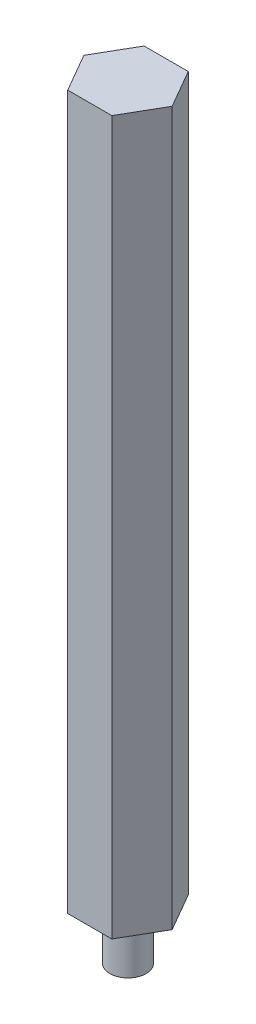
ISO-10303-21;
HEADER;
FILE_DESCRIPTION(('STEP AP214'),'2;1');
FILE_NAME('part.step','',(''),(''),'','','');
FILE_SCHEMA(('AUTOMOTIVE_DESIGN { 1 0 10303 214 1 1 1 1 }'));
ENDSEC;
DATA;
#1=APPLICATION_CONTEXT('core data for automotive mechanical design processes');
#2=APPLICATION_PROTOCOL_DEFINITION('international standard','automotive_design',2000,#1);
#3=PRODUCT_CONTEXT('',#1,'mechanical');
#4=PRODUCT('Part','Part','',(#3));
#5=PRODUCT_RELATED_PRODUCT_CATEGORY('part','',(#4));
#6=PRODUCT_DEFINITION_FORMATION('','',#4);
#7=PRODUCT_DEFINITION_CONTEXT('part definition',#1,'design');
#8=PRODUCT_DEFINITION('design','',#6,#7);
#9=PRODUCT_DEFINITION_SHAPE('','',#8);
#10=(LENGTH_UNIT() NAMED_UNIT(*) SI_UNIT(.MILLI.,.METRE.));
#11=(NAMED_UNIT(*) PLANE_ANGLE_UNIT() SI_UNIT($,.RADIAN.));
#12=(NAMED_UNIT(*) SI_UNIT($,.STERADIAN.) SOLID_ANGLE_UNIT());
#13=UNCERTAINTY_MEASURE_WITH_UNIT(LENGTH_MEASURE(1.E-05),#10,'distance_accuracy_value','');
#14=(GEOMETRIC_REPRESENTATION_CONTEXT(3) GLOBAL_UNCERTAINTY_ASSIGNED_CONTEXT((#13)) GLOBAL_UNIT_ASSIGNED_CONTEXT((#10,
#11,#12)) REPRESENTATION_CONTEXT('',''));
#15=CARTESIAN_POINT('',(0.,0.,0.));
#16=DIRECTION('',(0.,0.,1.));
#17=DIRECTION('',(1.,0.,0.));
#18=AXIS2_PLACEMENT_3D('',#15,#16,#17);
#19=CARTESIAN_POINT('',(3.66617420935413,127.,6.35));
#20=DIRECTION('',(-0.866025403784439,0.,-0.5));
#21=DIRECTION('',(-0.5,0.,0.866025403784439));
#22=AXIS2_PLACEMENT_3D('',#19,#20,#21);
#23=PLANE('',#22);
#24=DIRECTION('',(-0.5,0.,0.866025403784439));
#25=VECTOR('',#24,1.);
#26=CARTESIAN_POINT('',(3.66617420935413,8.50000000000001,6.35));
#27=LINE('',#26,#25);
#28=CARTESIAN_POINT('',(7.33234841870825,8.50000000000001,0.));
#29=VERTEX_POINT('',#28);
#30=CARTESIAN_POINT('',(3.66617420935413,8.50000000000001,6.35));
#31=VERTEX_POINT('',#30);
#32=EDGE_CURVE('E46',#29,#31,#27,.T.);
#33=ORIENTED_EDGE('',*,*,#32,.F.);
#34=DIRECTION('',(0.,-1.,0.));
#35=VECTOR('',#34,1.);
#36=CARTESIAN_POINT('',(7.33234841870825,127.,0.));
#37=LINE('',#36,#35);
#38=CARTESIAN_POINT('',(7.33234841870825,127.,0.));
#39=VERTEX_POINT('',#38);
#40=EDGE_CURVE('E40',#39,#29,#37,.T.);
#41=ORIENTED_EDGE('',*,*,#40,.F.);
#42=DIRECTION('',(0.5,0.,-0.866025403784439));
#43=VECTOR('',#42,1.);
#44=CARTESIAN_POINT('',(3.66617420935413,127.,6.35));
#45=LINE('',#44,#43);
#46=CARTESIAN_POINT('',(3.66617420935413,127.,6.35));
#47=VERTEX_POINT('',#46);
#48=EDGE_CURVE('E122',#47,#39,#45,.T.);
#49=ORIENTED_EDGE('',*,*,#48,.F.);
#50=DIRECTION('',(0.,-1.,0.));
#51=VECTOR('',#50,1.);
#52=CARTESIAN_POINT('',(3.66617420935413,127.,6.35));
#53=LINE('',#52,#51);
#54=EDGE_CURVE('E101',#47,#31,#53,.T.);
#55=ORIENTED_EDGE('',*,*,#54,.T.);
#56=EDGE_LOOP('',(#33,#41,#49,#55));
#57=FACE_BOUND('',#56,.T.);
#58=ADVANCED_FACE('F33',(#57),#23,.F.);
#59=CARTESIAN_POINT('',(7.33234841870825,127.,0.));
#60=DIRECTION('',(-0.866025403784439,0.,0.5));
#61=DIRECTION('',(0.5,0.,0.866025403784439));
#62=AXIS2_PLACEMENT_3D('',#59,#60,#61);
#63=PLANE('',#62);
#64=DIRECTION('',(0.5,0.,0.866025403784439));
#65=VECTOR('',#64,1.);
#66=CARTESIAN_POINT('',(7.33234841870825,8.50000000000001,0.));
#67=LINE('',#66,#65);
#68=CARTESIAN_POINT('',(3.66617420935412,8.50000000000001,-6.35000000000001));
#69=VERTEX_POINT('',#68);
#70=EDGE_CURVE('E118',#69,#29,#67,.T.);
#71=ORIENTED_EDGE('',*,*,#70,.F.);
#72=DIRECTION('',(0.,-1.,0.));
#73=VECTOR('',#72,1.);
#74=CARTESIAN_POINT('',(3.66617420935412,127.,-6.35000000000001));
#75=LINE('',#74,#73);
#76=CARTESIAN_POINT('',(3.66617420935412,127.,-6.35000000000001));
#77=VERTEX_POINT('',#76);
#78=EDGE_CURVE('E110',#77,#69,#75,.T.);
#79=ORIENTED_EDGE('',*,*,#78,.F.);
#80=DIRECTION('',(-0.5,0.,-0.866025403784439));
#81=VECTOR('',#80,1.);
#82=CARTESIAN_POINT('',(7.33234841870825,127.,0.));
#83=LINE('',#82,#81);
#84=EDGE_CURVE('E119',#39,#77,#83,.T.);
#85=ORIENTED_EDGE('',*,*,#84,.F.);
#86=ORIENTED_EDGE('',*,*,#40,.T.);
#87=EDGE_LOOP('',(#71,#79,#85,#86));
#88=FACE_BOUND('',#87,.T.);
#89=ADVANCED_FACE('F116',(#88),#63,.F.);
#90=CARTESIAN_POINT('',(3.66617420935412,127.,-6.35000000000001));
#91=DIRECTION('',(0.,0.,1.));
#92=DIRECTION('',(1.,0.,0.));
#93=AXIS2_PLACEMENT_3D('',#90,#91,#92);
#94=PLANE('',#93);
#95=DIRECTION('',(1.,0.,0.));
#96=VECTOR('',#95,1.);
#97=CARTESIAN_POINT('',(3.66617420935412,8.50000000000001,-6.35000000000001));
#98=LINE('',#97,#96);
#99=CARTESIAN_POINT('',(-3.66617420935413,8.50000000000001,-6.35000000000001));
#100=VERTEX_POINT('',#99);
#101=EDGE_CURVE('E125',#100,#69,#98,.T.);
#102=ORIENTED_EDGE('',*,*,#101,.F.);
#103=DIRECTION('',(0.,-1.,0.));
#104=VECTOR('',#103,1.);
#105=CARTESIAN_POINT('',(-3.66617420935413,127.,-6.35000000000001));
#106=LINE('',#105,#104);
#107=CARTESIAN_POINT('',(-3.66617420935413,127.,-6.35000000000001));
#108=VERTEX_POINT('',#107);
#109=EDGE_CURVE('E103',#108,#100,#106,.T.);
#110=ORIENTED_EDGE('',*,*,#109,.F.);
#111=DIRECTION('',(-1.,0.,0.));
#112=VECTOR('',#111,1.);
#113=CARTESIAN_POINT('',(3.66617420935412,127.,-6.35000000000001));
#114=LINE('',#113,#112);
#115=EDGE_CURVE('E130',#77,#108,#114,.T.);
#116=ORIENTED_EDGE('',*,*,#115,.F.);
#117=ORIENTED_EDGE('',*,*,#78,.T.);
#118=EDGE_LOOP('',(#102,#110,#116,#117));
#119=FACE_BOUND('',#118,.T.);
#120=ADVANCED_FACE('F168',(#119),#94,.F.);
#121=CARTESIAN_POINT('',(-3.66617420935413,127.,-6.35000000000001));
#122=DIRECTION('',(0.866025403784439,0.,0.499999999999999));
#123=DIRECTION('',(0.5,0.,-0.866025403784439));
#124=AXIS2_PLACEMENT_3D('',#121,#122,#123);
#125=PLANE('',#124);
#126=DIRECTION('',(0.5,0.,-0.866025403784439));
#127=VECTOR('',#126,1.);
#128=CARTESIAN_POINT('',(-3.66617420935413,8.50000000000001,-6.35000000000001));
#129=LINE('',#128,#127);
#130=CARTESIAN_POINT('',(-7.33234841870825,8.50000000000001,0.));
#131=VERTEX_POINT('',#130);
#132=EDGE_CURVE('E97',#131,#100,#129,.T.);
#133=ORIENTED_EDGE('',*,*,#132,.F.);
#134=DIRECTION('',(0.,-1.,0.));
#135=VECTOR('',#134,1.);
#136=CARTESIAN_POINT('',(-7.33234841870825,127.,0.));
#137=LINE('',#136,#135);
#138=CARTESIAN_POINT('',(-7.33234841870825,127.,0.));
#139=VERTEX_POINT('',#138);
#140=EDGE_CURVE('E96',#139,#131,#137,.T.);
#141=ORIENTED_EDGE('',*,*,#140,.F.);
#142=DIRECTION('',(-0.5,0.,0.866025403784439));
#143=VECTOR('',#142,1.);
#144=CARTESIAN_POINT('',(-3.66617420935413,127.,-6.35000000000001));
#145=LINE('',#144,#143);
#146=EDGE_CURVE('E132',#108,#139,#145,.T.);
#147=ORIENTED_EDGE('',*,*,#146,.F.);
#148=ORIENTED_EDGE('',*,*,#109,.T.);
#149=EDGE_LOOP('',(#133,#141,#147,#148));
#150=FACE_BOUND('',#149,.T.);
#151=ADVANCED_FACE('F140',(#150),#125,.F.);
#152=CARTESIAN_POINT('',(-7.33234841870825,127.,0.));
#153=DIRECTION('',(0.866025403784438,0.,-0.5));
#154=DIRECTION('',(-0.5,0.,-0.866025403784438));
#155=AXIS2_PLACEMENT_3D('',#152,#153,#154);
#156=PLANE('',#155);
#157=DIRECTION('',(-0.5,0.,-0.866025403784438));
#158=VECTOR('',#157,1.);
#159=CARTESIAN_POINT('',(-7.33234841870825,8.50000000000001,0.));
#160=LINE('',#159,#158);
#161=CARTESIAN_POINT('',(-3.66617420935412,8.50000000000001,6.35));
#162=VERTEX_POINT('',#161);
#163=EDGE_CURVE('E84',#162,#131,#160,.T.);
#164=ORIENTED_EDGE('',*,*,#163,.F.);
#165=DIRECTION('',(0.,-1.,0.));
#166=VECTOR('',#165,1.);
#167=CARTESIAN_POINT('',(-3.66617420935412,127.,6.35));
#168=LINE('',#167,#166);
#169=CARTESIAN_POINT('',(-3.66617420935412,127.,6.35));
#170=VERTEX_POINT('',#169);
#171=EDGE_CURVE('E94',#170,#162,#168,.T.);
#172=ORIENTED_EDGE('',*,*,#171,.F.);
#173=DIRECTION('',(0.5,0.,0.866025403784438));
#174=VECTOR('',#173,1.);
#175=CARTESIAN_POINT('',(-7.33234841870825,127.,0.));
#176=LINE('',#175,#174);
#177=EDGE_CURVE('E134',#139,#170,#176,.T.);
#178=ORIENTED_EDGE('',*,*,#177,.F.);
#179=ORIENTED_EDGE('',*,*,#140,.T.);
#180=EDGE_LOOP('',(#164,#172,#178,#179));
#181=FACE_BOUND('',#180,.T.);
#182=ADVANCED_FACE('F92',(#181),#156,.F.);
#183=CARTESIAN_POINT('',(-3.66617420935412,127.,6.35));
#184=DIRECTION('',(0.,0.,-1.));
#185=DIRECTION('',(-1.,0.,0.));
#186=AXIS2_PLACEMENT_3D('',#183,#184,#185);
#187=PLANE('',#186);
#188=DIRECTION('',(-1.,0.,0.));
#189=VECTOR('',#188,1.);
#190=CARTESIAN_POINT('',(-3.66617420935412,8.50000000000001,6.35));
#191=LINE('',#190,#189);
#192=EDGE_CURVE('E11',#31,#162,#191,.T.);
#193=ORIENTED_EDGE('',*,*,#192,.F.);
#194=ORIENTED_EDGE('',*,*,#54,.F.);
#195=DIRECTION('',(1.,0.,0.));
#196=VECTOR('',#195,1.);
#197=CARTESIAN_POINT('',(-3.66617420935412,127.,6.35));
#198=LINE('',#197,#196);
#199=EDGE_CURVE('E54',#170,#47,#198,.T.);
#200=ORIENTED_EDGE('',*,*,#199,.F.);
#201=ORIENTED_EDGE('',*,*,#171,.T.);
#202=EDGE_LOOP('',(#193,#194,#200,#201));
#203=FACE_BOUND('',#202,.T.);
#204=ADVANCED_FACE('F100',(#203),#187,.F.);
#205=CARTESIAN_POINT('',(0.,127.,0.));
#206=DIRECTION('',(0.,1.,0.));
#207=DIRECTION('',(0.,0.,1.));
#208=AXIS2_PLACEMENT_3D('',#205,#206,#207);
#209=PLANE('',#208);
#210=ORIENTED_EDGE('',*,*,#48,.T.);
#211=ORIENTED_EDGE('',*,*,#84,.T.);
#212=ORIENTED_EDGE('',*,*,#115,.T.);
#213=ORIENTED_EDGE('',*,*,#146,.T.);
#214=ORIENTED_EDGE('',*,*,#177,.T.);
#215=ORIENTED_EDGE('',*,*,#199,.T.);
#216=EDGE_LOOP('',(#210,#211,#212,#213,#214,#215));
#217=FACE_BOUND('',#216,.T.);
#218=ADVANCED_FACE('F135',(#217),#209,.T.);
#219=CARTESIAN_POINT('',(0.,8.5,0.));
#220=DIRECTION('',(0.,-1.,0.));
#221=DIRECTION('',(0.,0.,-1.));
#222=AXIS2_PLACEMENT_3D('',#219,#220,#221);
#223=PLANE('',#222);
#224=CARTESIAN_POINT('',(0.,8.5,0.));
#225=DIRECTION('',(0.,-1.,0.));
#226=DIRECTION('',(0.,0.,-1.));
#227=AXIS2_PLACEMENT_3D('',#224,#225,#226);
#228=CIRCLE('',#227,3.);
#229=CARTESIAN_POINT('',(0.,8.5,-3.));
#230=VERTEX_POINT('',#229);
#231=EDGE_CURVE('E98',#230,#230,#228,.T.);
#232=ORIENTED_EDGE('',*,*,#231,.F.);
#233=EDGE_LOOP('',(#232));
#234=FACE_BOUND('',#233,.T.);
#235=ORIENTED_EDGE('',*,*,#32,.T.);
#236=ORIENTED_EDGE('',*,*,#192,.T.);
#237=ORIENTED_EDGE('',*,*,#163,.T.);
#238=ORIENTED_EDGE('',*,*,#132,.T.);
#239=ORIENTED_EDGE('',*,*,#101,.T.);
#240=ORIENTED_EDGE('',*,*,#70,.T.);
#241=EDGE_LOOP('',(#235,#236,#237,#238,#239,#240));
#242=FACE_BOUND('',#241,.T.);
#243=ADVANCED_FACE('F83',(#234,#242),#223,.T.);
#244=CARTESIAN_POINT('',(0.,8.5,0.));
#245=DIRECTION('',(0.,-1.,0.));
#246=DIRECTION('',(0.,0.,-1.));
#247=AXIS2_PLACEMENT_3D('',#244,#245,#246);
#248=CYLINDRICAL_SURFACE('',#247,3.);
#249=ORIENTED_EDGE('',*,*,#231,.T.);
#250=EDGE_LOOP('',(#249));
#251=FACE_BOUND('',#250,.T.);
#252=CARTESIAN_POINT('',(0.,0.,0.));
#253=DIRECTION('',(0.,-1.,0.));
#254=DIRECTION('',(0.,0.,-1.));
#255=AXIS2_PLACEMENT_3D('',#252,#253,#254);
#256=CIRCLE('',#255,3.);
#257=CARTESIAN_POINT('',(0.,0.,-3.));
#258=VERTEX_POINT('',#257);
#259=EDGE_CURVE('E144',#258,#258,#256,.T.);
#260=ORIENTED_EDGE('',*,*,#259,.F.);
#261=EDGE_LOOP('',(#260));
#262=FACE_BOUND('',#261,.T.);
#263=ADVANCED_FACE('F150',(#251,#262),#248,.T.);
#264=CARTESIAN_POINT('',(0.,0.,0.));
#265=DIRECTION('',(0.,1.,0.));
#266=DIRECTION('',(0.,0.,1.));
#267=AXIS2_PLACEMENT_3D('',#264,#265,#266);
#268=PLANE('',#267);
#269=ORIENTED_EDGE('',*,*,#259,.T.);
#270=EDGE_LOOP('',(#269));
#271=FACE_BOUND('',#270,.T.);
#272=ADVANCED_FACE('F159',(#271),#268,.F.);
#273=CLOSED_SHELL('',(#58,#89,#120,#151,#182,#204,#218,#243,#263,#272));
#274=MANIFOLD_SOLID_BREP('B2',#273);
#275=ADVANCED_BREP_SHAPE_REPRESENTATION('',(#18,#274),#14);
#276=SHAPE_DEFINITION_REPRESENTATION(#9,#275);
ENDSEC;
END-ISO-10303-21;
